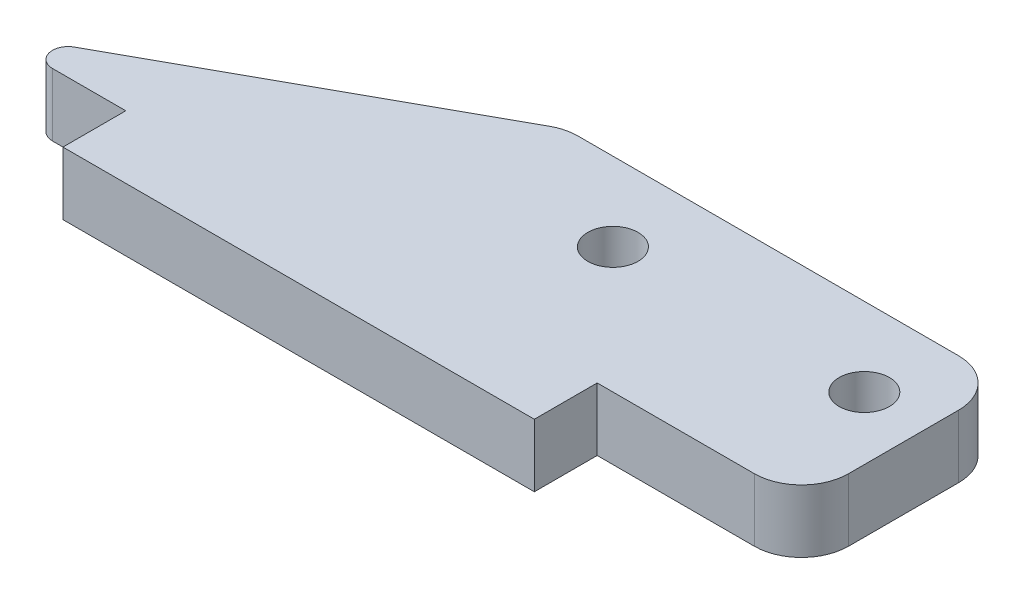
ISO-10303-21;
HEADER;
FILE_DESCRIPTION(('STEP AP214'),'2;1');
FILE_NAME('part.step','',(''),(''),'','','');
FILE_SCHEMA(('AUTOMOTIVE_DESIGN { 1 0 10303 214 1 1 1 1 }'));
ENDSEC;
DATA;
#1=APPLICATION_CONTEXT('core data for automotive mechanical design processes');
#2=APPLICATION_PROTOCOL_DEFINITION('international standard','automotive_design',2000,#1);
#3=PRODUCT_CONTEXT('',#1,'mechanical');
#4=PRODUCT('Part','Part','',(#3));
#5=PRODUCT_RELATED_PRODUCT_CATEGORY('part','',(#4));
#6=PRODUCT_DEFINITION_FORMATION('','',#4);
#7=PRODUCT_DEFINITION_CONTEXT('part definition',#1,'design');
#8=PRODUCT_DEFINITION('design','',#6,#7);
#9=PRODUCT_DEFINITION_SHAPE('','',#8);
#10=(LENGTH_UNIT() NAMED_UNIT(*) SI_UNIT(.MILLI.,.METRE.));
#11=(NAMED_UNIT(*) PLANE_ANGLE_UNIT() SI_UNIT($,.RADIAN.));
#12=(NAMED_UNIT(*) SI_UNIT($,.STERADIAN.) SOLID_ANGLE_UNIT());
#13=UNCERTAINTY_MEASURE_WITH_UNIT(LENGTH_MEASURE(1.E-05),#10,'distance_accuracy_value','');
#14=(GEOMETRIC_REPRESENTATION_CONTEXT(3) GLOBAL_UNCERTAINTY_ASSIGNED_CONTEXT((#13)) GLOBAL_UNIT_ASSIGNED_CONTEXT((#10,
#11,#12)) REPRESENTATION_CONTEXT('',''));
#15=CARTESIAN_POINT('',(0.,0.,0.));
#16=DIRECTION('',(0.,0.,1.));
#17=DIRECTION('',(1.,0.,0.));
#18=AXIS2_PLACEMENT_3D('',#15,#16,#17);
#19=CARTESIAN_POINT('',(-5.50070912957885,4.,-9.96297546508316));
#20=DIRECTION('',(-0.483339706538455,0.,-0.875432880398789));
#21=DIRECTION('',(-0.875432880398789,0.,0.483339706538455));
#22=AXIS2_PLACEMENT_3D('',#19,#20,#21);
#23=PLANE('',#22);
#24=DIRECTION('',(0.875432880398789,0.,-0.483339706538455));
#25=VECTOR('',#24,1.);
#26=CARTESIAN_POINT('',(-5.50070912957885,0.,-9.96297546508316));
#27=LINE('',#26,#25);
#28=CARTESIAN_POINT('',(-20.1490001854985,0.,-1.87543288039879));
#29=VERTEX_POINT('',#28);
#30=CARTESIAN_POINT('',(-0.676854089413362,0.,-12.6262986411964));
#31=VERTEX_POINT('',#30);
#32=EDGE_CURVE('E210',#29,#31,#27,.T.);
#33=ORIENTED_EDGE('',*,*,#32,.F.);
#34=DIRECTION('',(0.,-1.,0.));
#35=VECTOR('',#34,1.);
#36=CARTESIAN_POINT('',(-20.1490001854985,4.,-1.87543288039879));
#37=LINE('',#36,#35);
#38=CARTESIAN_POINT('',(-20.1490001854985,4.,-1.87543288039879));
#39=VERTEX_POINT('',#38);
#40=EDGE_CURVE('E48',#29,#39,#37,.F.);
#41=ORIENTED_EDGE('',*,*,#40,.T.);
#42=DIRECTION('',(0.875432880398789,0.,-0.483339706538455));
#43=VECTOR('',#42,1.);
#44=CARTESIAN_POINT('',(-5.50070912957885,4.,-9.96297546508316));
#45=LINE('',#44,#43);
#46=CARTESIAN_POINT('',(-0.676854089413362,4.,-12.6262986411964));
#47=VERTEX_POINT('',#46);
#48=EDGE_CURVE('E139',#39,#47,#45,.T.);
#49=ORIENTED_EDGE('',*,*,#48,.T.);
#50=DIRECTION('',(0.,-1.,0.));
#51=VECTOR('',#50,1.);
#52=CARTESIAN_POINT('',(-0.676854089413362,0.,-12.6262986411964));
#53=LINE('',#52,#51);
#54=EDGE_CURVE('E197',#47,#31,#53,.T.);
#55=ORIENTED_EDGE('',*,*,#54,.T.);
#56=EDGE_LOOP('',(#33,#41,#49,#55));
#57=FACE_BOUND('',#56,.T.);
#58=ADVANCED_FACE('F39',(#57),#23,.T.);
#59=CARTESIAN_POINT('',(0.,4.,0.));
#60=DIRECTION('',(0.,0.,-1.));
#61=DIRECTION('',(-1.,0.,0.));
#62=AXIS2_PLACEMENT_3D('',#59,#60,#61);
#63=PLANE('',#62);
#64=DIRECTION('',(1.,0.,0.));
#65=VECTOR('',#64,1.);
#66=CARTESIAN_POINT('',(0.,4.,0.));
#67=LINE('',#66,#65);
#68=CARTESIAN_POINT('',(-19.6656604789601,4.,0.));
#69=VERTEX_POINT('',#68);
#70=CARTESIAN_POINT('',(-15.,4.,0.));
#71=VERTEX_POINT('',#70);
#72=EDGE_CURVE('E127',#69,#71,#67,.T.);
#73=ORIENTED_EDGE('',*,*,#72,.F.);
#74=DIRECTION('',(0.,-1.,0.));
#75=VECTOR('',#74,1.);
#76=CARTESIAN_POINT('',(-19.6656604789601,0.,0.));
#77=LINE('',#76,#75);
#78=CARTESIAN_POINT('',(-19.6656604789601,0.,0.));
#79=VERTEX_POINT('',#78);
#80=EDGE_CURVE('E201',#69,#79,#77,.T.);
#81=ORIENTED_EDGE('',*,*,#80,.T.);
#82=DIRECTION('',(1.,0.,0.));
#83=VECTOR('',#82,1.);
#84=CARTESIAN_POINT('',(0.,0.,0.));
#85=LINE('',#84,#83);
#86=CARTESIAN_POINT('',(-15.,0.,0.));
#87=VERTEX_POINT('',#86);
#88=EDGE_CURVE('E152',#79,#87,#85,.T.);
#89=ORIENTED_EDGE('',*,*,#88,.T.);
#90=DIRECTION('',(0.,-1.,0.));
#91=VECTOR('',#90,1.);
#92=CARTESIAN_POINT('',(-15.,4.,0.));
#93=LINE('',#92,#91);
#94=EDGE_CURVE('E145',#71,#87,#93,.T.);
#95=ORIENTED_EDGE('',*,*,#94,.F.);
#96=EDGE_LOOP('',(#73,#81,#89,#95));
#97=FACE_BOUND('',#96,.T.);
#98=ADVANCED_FACE('F151',(#97),#63,.F.);
#99=CARTESIAN_POINT('',(-15.,4.,0.));
#100=DIRECTION('',(1.,0.,0.));
#101=DIRECTION('',(0.,0.,-1.));
#102=AXIS2_PLACEMENT_3D('',#99,#100,#101);
#103=PLANE('',#102);
#104=DIRECTION('',(0.,0.,1.));
#105=VECTOR('',#104,1.);
#106=CARTESIAN_POINT('',(-15.,0.,0.));
#107=LINE('',#106,#105);
#108=CARTESIAN_POINT('',(-15.,0.,4.));
#109=VERTEX_POINT('',#108);
#110=EDGE_CURVE('E208',#87,#109,#107,.T.);
#111=ORIENTED_EDGE('',*,*,#110,.T.);
#112=DIRECTION('',(0.,-1.,0.));
#113=VECTOR('',#112,1.);
#114=CARTESIAN_POINT('',(-15.,4.,4.));
#115=LINE('',#114,#113);
#116=CARTESIAN_POINT('',(-15.,4.,4.));
#117=VERTEX_POINT('',#116);
#118=EDGE_CURVE('E147',#117,#109,#115,.T.);
#119=ORIENTED_EDGE('',*,*,#118,.F.);
#120=DIRECTION('',(0.,0.,1.));
#121=VECTOR('',#120,1.);
#122=CARTESIAN_POINT('',(-15.,4.,0.));
#123=LINE('',#122,#121);
#124=EDGE_CURVE('E131',#71,#117,#123,.T.);
#125=ORIENTED_EDGE('',*,*,#124,.F.);
#126=ORIENTED_EDGE('',*,*,#94,.T.);
#127=EDGE_LOOP('',(#111,#119,#125,#126));
#128=FACE_BOUND('',#127,.T.);
#129=ADVANCED_FACE('F144',(#128),#103,.F.);
#130=CARTESIAN_POINT('',(0.,4.,4.));
#131=DIRECTION('',(0.,0.,-1.));
#132=DIRECTION('',(-1.,0.,0.));
#133=AXIS2_PLACEMENT_3D('',#130,#131,#132);
#134=PLANE('',#133);
#135=DIRECTION('',(1.,0.,0.));
#136=VECTOR('',#135,1.);
#137=CARTESIAN_POINT('',(0.,0.,4.));
#138=LINE('',#137,#136);
#139=CARTESIAN_POINT('',(15.,0.,4.));
#140=VERTEX_POINT('',#139);
#141=EDGE_CURVE('E214',#109,#140,#138,.T.);
#142=ORIENTED_EDGE('',*,*,#141,.T.);
#143=DIRECTION('',(0.,-1.,0.));
#144=VECTOR('',#143,1.);
#145=CARTESIAN_POINT('',(15.,4.,4.));
#146=LINE('',#145,#144);
#147=CARTESIAN_POINT('',(15.,4.,4.));
#148=VERTEX_POINT('',#147);
#149=EDGE_CURVE('E161',#148,#140,#146,.T.);
#150=ORIENTED_EDGE('',*,*,#149,.F.);
#151=DIRECTION('',(1.,0.,0.));
#152=VECTOR('',#151,1.);
#153=CARTESIAN_POINT('',(0.,4.,4.));
#154=LINE('',#153,#152);
#155=EDGE_CURVE('E149',#117,#148,#154,.T.);
#156=ORIENTED_EDGE('',*,*,#155,.F.);
#157=ORIENTED_EDGE('',*,*,#118,.T.);
#158=EDGE_LOOP('',(#142,#150,#156,#157));
#159=FACE_BOUND('',#158,.T.);
#160=ADVANCED_FACE('F253',(#159),#134,.F.);
#161=CARTESIAN_POINT('',(15.,4.,0.));
#162=DIRECTION('',(-1.,0.,0.));
#163=DIRECTION('',(0.,0.,1.));
#164=AXIS2_PLACEMENT_3D('',#161,#162,#163);
#165=PLANE('',#164);
#166=DIRECTION('',(0.,0.,-1.));
#167=VECTOR('',#166,1.);
#168=CARTESIAN_POINT('',(15.,0.,0.));
#169=LINE('',#168,#167);
#170=CARTESIAN_POINT('',(15.,0.,0.));
#171=VERTEX_POINT('',#170);
#172=EDGE_CURVE('E223',#140,#171,#169,.T.);
#173=ORIENTED_EDGE('',*,*,#172,.T.);
#174=DIRECTION('',(0.,-1.,0.));
#175=VECTOR('',#174,1.);
#176=CARTESIAN_POINT('',(15.,4.,0.));
#177=LINE('',#176,#175);
#178=CARTESIAN_POINT('',(15.,4.,0.));
#179=VERTEX_POINT('',#178);
#180=EDGE_CURVE('E240',#179,#171,#177,.T.);
#181=ORIENTED_EDGE('',*,*,#180,.F.);
#182=DIRECTION('',(0.,0.,-1.));
#183=VECTOR('',#182,1.);
#184=CARTESIAN_POINT('',(15.,4.,0.));
#185=LINE('',#184,#183);
#186=EDGE_CURVE('E251',#148,#179,#185,.T.);
#187=ORIENTED_EDGE('',*,*,#186,.F.);
#188=ORIENTED_EDGE('',*,*,#149,.T.);
#189=EDGE_LOOP('',(#173,#181,#187,#188));
#190=FACE_BOUND('',#189,.T.);
#191=ADVANCED_FACE('F248',(#190),#165,.F.);
#192=CARTESIAN_POINT('',(0.,4.,0.));
#193=DIRECTION('',(0.,0.,-1.));
#194=DIRECTION('',(-1.,0.,0.));
#195=AXIS2_PLACEMENT_3D('',#192,#193,#194);
#196=PLANE('',#195);
#197=DIRECTION('',(1.,0.,0.));
#198=VECTOR('',#197,1.);
#199=CARTESIAN_POINT('',(0.,0.,0.));
#200=LINE('',#199,#198);
#201=CARTESIAN_POINT('',(25.,0.,0.));
#202=VERTEX_POINT('',#201);
#203=EDGE_CURVE('E227',#171,#202,#200,.T.);
#204=ORIENTED_EDGE('',*,*,#203,.T.);
#205=DIRECTION('',(0.,-1.,0.));
#206=VECTOR('',#205,1.);
#207=CARTESIAN_POINT('',(25.,4.,0.));
#208=LINE('',#207,#206);
#209=CARTESIAN_POINT('',(25.,4.,0.));
#210=VERTEX_POINT('',#209);
#211=EDGE_CURVE('E194',#202,#210,#208,.F.);
#212=ORIENTED_EDGE('',*,*,#211,.T.);
#213=DIRECTION('',(1.,0.,0.));
#214=VECTOR('',#213,1.);
#215=CARTESIAN_POINT('',(0.,4.,0.));
#216=LINE('',#215,#214);
#217=EDGE_CURVE('E259',#179,#210,#216,.T.);
#218=ORIENTED_EDGE('',*,*,#217,.F.);
#219=ORIENTED_EDGE('',*,*,#180,.T.);
#220=EDGE_LOOP('',(#204,#212,#218,#219));
#221=FACE_BOUND('',#220,.T.);
#222=ADVANCED_FACE('F257',(#221),#196,.F.);
#223=CARTESIAN_POINT('',(28.,4.,0.));
#224=DIRECTION('',(-1.,0.,0.));
#225=DIRECTION('',(0.,0.,1.));
#226=AXIS2_PLACEMENT_3D('',#223,#224,#225);
#227=PLANE('',#226);
#228=DIRECTION('',(0.,0.,-1.));
#229=VECTOR('',#228,1.);
#230=CARTESIAN_POINT('',(28.,0.,0.));
#231=LINE('',#230,#229);
#232=CARTESIAN_POINT('',(28.,0.,-3.));
#233=VERTEX_POINT('',#232);
#234=CARTESIAN_POINT('',(28.,0.,-10.));
#235=VERTEX_POINT('',#234);
#236=EDGE_CURVE('E231',#233,#235,#231,.T.);
#237=ORIENTED_EDGE('',*,*,#236,.T.);
#238=DIRECTION('',(0.,-1.,0.));
#239=VECTOR('',#238,1.);
#240=CARTESIAN_POINT('',(28.,4.,-10.));
#241=LINE('',#240,#239);
#242=CARTESIAN_POINT('',(28.,4.,-10.));
#243=VERTEX_POINT('',#242);
#244=EDGE_CURVE('E181',#235,#243,#241,.F.);
#245=ORIENTED_EDGE('',*,*,#244,.T.);
#246=DIRECTION('',(0.,0.,-1.));
#247=VECTOR('',#246,1.);
#248=CARTESIAN_POINT('',(28.,4.,0.));
#249=LINE('',#248,#247);
#250=CARTESIAN_POINT('',(28.,4.,-3.));
#251=VERTEX_POINT('',#250);
#252=EDGE_CURVE('E262',#251,#243,#249,.T.);
#253=ORIENTED_EDGE('',*,*,#252,.F.);
#254=DIRECTION('',(0.,-1.,0.));
#255=VECTOR('',#254,1.);
#256=CARTESIAN_POINT('',(28.,4.,-3.));
#257=LINE('',#256,#255);
#258=EDGE_CURVE('E177',#251,#233,#257,.T.);
#259=ORIENTED_EDGE('',*,*,#258,.T.);
#260=EDGE_LOOP('',(#237,#245,#253,#259));
#261=FACE_BOUND('',#260,.T.);
#262=ADVANCED_FACE('F286',(#261),#227,.F.);
#263=CARTESIAN_POINT('',(8.,4.,-8.));
#264=DIRECTION('',(0.,-1.,0.));
#265=DIRECTION('',(0.,0.,-1.));
#266=AXIS2_PLACEMENT_3D('',#263,#264,#265);
#267=CYLINDRICAL_SURFACE('',#266,1.6);
#268=CARTESIAN_POINT('',(8.,4.,-8.));
#269=DIRECTION('',(0.,1.,0.));
#270=DIRECTION('',(0.,0.,1.));
#271=AXIS2_PLACEMENT_3D('',#268,#269,#270);
#272=CIRCLE('',#271,1.6);
#273=CARTESIAN_POINT('',(8.,4.,-6.4));
#274=VERTEX_POINT('',#273);
#275=EDGE_CURVE('E329',#274,#274,#272,.T.);
#276=ORIENTED_EDGE('',*,*,#275,.T.);
#277=EDGE_LOOP('',(#276));
#278=FACE_BOUND('',#277,.T.);
#279=CARTESIAN_POINT('',(8.,0.,-8.));
#280=DIRECTION('',(0.,1.,0.));
#281=DIRECTION('',(0.,0.,1.));
#282=AXIS2_PLACEMENT_3D('',#279,#280,#281);
#283=CIRCLE('',#282,1.6);
#284=CARTESIAN_POINT('',(8.,0.,-6.4));
#285=VERTEX_POINT('',#284);
#286=EDGE_CURVE('E216',#285,#285,#283,.T.);
#287=ORIENTED_EDGE('',*,*,#286,.F.);
#288=EDGE_LOOP('',(#287));
#289=FACE_BOUND('',#288,.T.);
#290=ADVANCED_FACE('F283',(#278,#289),#267,.F.);
#291=CARTESIAN_POINT('',(24.,4.,-8.));
#292=DIRECTION('',(0.,-1.,0.));
#293=DIRECTION('',(0.,0.,-1.));
#294=AXIS2_PLACEMENT_3D('',#291,#292,#293);
#295=CYLINDRICAL_SURFACE('',#294,1.6);
#296=CARTESIAN_POINT('',(24.,4.,-8.));
#297=DIRECTION('',(0.,1.,0.));
#298=DIRECTION('',(0.,0.,1.));
#299=AXIS2_PLACEMENT_3D('',#296,#297,#298);
#300=CIRCLE('',#299,1.6);
#301=CARTESIAN_POINT('',(24.,4.,-6.4));
#302=VERTEX_POINT('',#301);
#303=EDGE_CURVE('E239',#302,#302,#300,.T.);
#304=ORIENTED_EDGE('',*,*,#303,.T.);
#305=EDGE_LOOP('',(#304));
#306=FACE_BOUND('',#305,.T.);
#307=CARTESIAN_POINT('',(24.,0.,-8.));
#308=DIRECTION('',(0.,1.,0.));
#309=DIRECTION('',(0.,0.,1.));
#310=AXIS2_PLACEMENT_3D('',#307,#308,#309);
#311=CIRCLE('',#310,1.6);
#312=CARTESIAN_POINT('',(24.,0.,-6.4));
#313=VERTEX_POINT('',#312);
#314=EDGE_CURVE('E275',#313,#313,#311,.T.);
#315=ORIENTED_EDGE('',*,*,#314,.F.);
#316=EDGE_LOOP('',(#315));
#317=FACE_BOUND('',#316,.T.);
#318=ADVANCED_FACE('F285',(#306,#317),#295,.F.);
#319=CARTESIAN_POINT('',(0.,4.,-13.));
#320=DIRECTION('',(0.,0.,1.));
#321=DIRECTION('',(1.,0.,0.));
#322=AXIS2_PLACEMENT_3D('',#319,#320,#321);
#323=PLANE('',#322);
#324=DIRECTION('',(-1.,0.,0.));
#325=VECTOR('',#324,1.);
#326=CARTESIAN_POINT('',(0.,4.,-13.));
#327=LINE('',#326,#325);
#328=CARTESIAN_POINT('',(25.,4.,-13.));
#329=VERTEX_POINT('',#328);
#330=CARTESIAN_POINT('',(0.773165030202004,4.,-13.));
#331=VERTEX_POINT('',#330);
#332=EDGE_CURVE('E243',#329,#331,#327,.T.);
#333=ORIENTED_EDGE('',*,*,#332,.F.);
#334=DIRECTION('',(0.,-1.,0.));
#335=VECTOR('',#334,1.);
#336=CARTESIAN_POINT('',(25.,4.,-13.));
#337=LINE('',#336,#335);
#338=CARTESIAN_POINT('',(25.,0.,-13.));
#339=VERTEX_POINT('',#338);
#340=EDGE_CURVE('E159',#329,#339,#337,.T.);
#341=ORIENTED_EDGE('',*,*,#340,.T.);
#342=DIRECTION('',(-1.,0.,0.));
#343=VECTOR('',#342,1.);
#344=CARTESIAN_POINT('',(0.,0.,-13.));
#345=LINE('',#344,#343);
#346=CARTESIAN_POINT('',(0.773165030202004,0.,-13.));
#347=VERTEX_POINT('',#346);
#348=EDGE_CURVE('E235',#339,#347,#345,.T.);
#349=ORIENTED_EDGE('',*,*,#348,.T.);
#350=DIRECTION('',(0.,-1.,0.));
#351=VECTOR('',#350,1.);
#352=CARTESIAN_POINT('',(0.773165030202004,4.,-13.));
#353=LINE('',#352,#351);
#354=EDGE_CURVE('E155',#347,#331,#353,.F.);
#355=ORIENTED_EDGE('',*,*,#354,.T.);
#356=EDGE_LOOP('',(#333,#341,#349,#355));
#357=FACE_BOUND('',#356,.T.);
#358=ADVANCED_FACE('F293',(#357),#323,.F.);
#359=CARTESIAN_POINT('',(0.,4.,0.));
#360=DIRECTION('',(0.,1.,0.));
#361=DIRECTION('',(0.,0.,1.));
#362=AXIS2_PLACEMENT_3D('',#359,#360,#361);
#363=PLANE('',#362);
#364=ORIENTED_EDGE('',*,*,#303,.F.);
#365=EDGE_LOOP('',(#364));
#366=FACE_BOUND('',#365,.T.);
#367=ORIENTED_EDGE('',*,*,#275,.F.);
#368=EDGE_LOOP('',(#367));
#369=FACE_BOUND('',#368,.T.);
#370=ORIENTED_EDGE('',*,*,#48,.F.);
#371=CARTESIAN_POINT('',(-19.6656604789601,4.,-1.));
#372=DIRECTION('',(0.,1.,0.));
#373=DIRECTION('',(0.,0.,1.));
#374=AXIS2_PLACEMENT_3D('',#371,#372,#373);
#375=CIRCLE('',#374,1.);
#376=EDGE_CURVE('E11',#39,#69,#375,.T.);
#377=ORIENTED_EDGE('',*,*,#376,.T.);
#378=ORIENTED_EDGE('',*,*,#72,.T.);
#379=ORIENTED_EDGE('',*,*,#124,.T.);
#380=ORIENTED_EDGE('',*,*,#155,.T.);
#381=ORIENTED_EDGE('',*,*,#186,.T.);
#382=ORIENTED_EDGE('',*,*,#217,.T.);
#383=CARTESIAN_POINT('',(25.,4.,-3.));
#384=DIRECTION('',(0.,1.,0.));
#385=DIRECTION('',(0.,0.,1.));
#386=AXIS2_PLACEMENT_3D('',#383,#384,#385);
#387=CIRCLE('',#386,3.);
#388=EDGE_CURVE('E188',#210,#251,#387,.T.);
#389=ORIENTED_EDGE('',*,*,#388,.T.);
#390=ORIENTED_EDGE('',*,*,#252,.T.);
#391=CARTESIAN_POINT('',(25.,4.,-10.));
#392=DIRECTION('',(0.,1.,0.));
#393=DIRECTION('',(0.,0.,1.));
#394=AXIS2_PLACEMENT_3D('',#391,#392,#393);
#395=CIRCLE('',#394,3.);
#396=EDGE_CURVE('E191',#243,#329,#395,.T.);
#397=ORIENTED_EDGE('',*,*,#396,.T.);
#398=ORIENTED_EDGE('',*,*,#332,.T.);
#399=CARTESIAN_POINT('',(0.773165030202004,4.,-10.));
#400=DIRECTION('',(0.,1.,0.));
#401=DIRECTION('',(0.,0.,1.));
#402=AXIS2_PLACEMENT_3D('',#399,#400,#401);
#403=CIRCLE('',#402,3.);
#404=EDGE_CURVE('E184',#331,#47,#403,.T.);
#405=ORIENTED_EDGE('',*,*,#404,.T.);
#406=EDGE_LOOP('',(#370,#377,#378,#379,#380,#381,#382,#389,#390,#397,#398,#405));
#407=FACE_BOUND('',#406,.T.);
#408=ADVANCED_FACE('F129',(#366,#369,#407),#363,.T.);
#409=CARTESIAN_POINT('',(0.,0.,0.));
#410=DIRECTION('',(0.,1.,0.));
#411=DIRECTION('',(0.,0.,1.));
#412=AXIS2_PLACEMENT_3D('',#409,#410,#411);
#413=PLANE('',#412);
#414=ORIENTED_EDGE('',*,*,#314,.T.);
#415=EDGE_LOOP('',(#414));
#416=FACE_BOUND('',#415,.T.);
#417=ORIENTED_EDGE('',*,*,#286,.T.);
#418=EDGE_LOOP('',(#417));
#419=FACE_BOUND('',#418,.T.);
#420=ORIENTED_EDGE('',*,*,#88,.F.);
#421=CARTESIAN_POINT('',(-19.6656604789601,0.,-1.));
#422=DIRECTION('',(0.,1.,0.));
#423=DIRECTION('',(0.,0.,1.));
#424=AXIS2_PLACEMENT_3D('',#421,#422,#423);
#425=CIRCLE('',#424,1.);
#426=EDGE_CURVE('E62',#79,#29,#425,.F.);
#427=ORIENTED_EDGE('',*,*,#426,.T.);
#428=ORIENTED_EDGE('',*,*,#32,.T.);
#429=CARTESIAN_POINT('',(0.773165030202004,0.,-10.));
#430=DIRECTION('',(0.,1.,0.));
#431=DIRECTION('',(0.,0.,1.));
#432=AXIS2_PLACEMENT_3D('',#429,#430,#431);
#433=CIRCLE('',#432,3.);
#434=EDGE_CURVE('E168',#31,#347,#433,.F.);
#435=ORIENTED_EDGE('',*,*,#434,.T.);
#436=ORIENTED_EDGE('',*,*,#348,.F.);
#437=CARTESIAN_POINT('',(25.,0.,-10.));
#438=DIRECTION('',(0.,1.,0.));
#439=DIRECTION('',(0.,0.,1.));
#440=AXIS2_PLACEMENT_3D('',#437,#438,#439);
#441=CIRCLE('',#440,3.);
#442=EDGE_CURVE('E174',#339,#235,#441,.F.);
#443=ORIENTED_EDGE('',*,*,#442,.T.);
#444=ORIENTED_EDGE('',*,*,#236,.F.);
#445=CARTESIAN_POINT('',(25.,0.,-3.));
#446=DIRECTION('',(0.,1.,0.));
#447=DIRECTION('',(0.,0.,1.));
#448=AXIS2_PLACEMENT_3D('',#445,#446,#447);
#449=CIRCLE('',#448,3.);
#450=EDGE_CURVE('E171',#233,#202,#449,.F.);
#451=ORIENTED_EDGE('',*,*,#450,.T.);
#452=ORIENTED_EDGE('',*,*,#203,.F.);
#453=ORIENTED_EDGE('',*,*,#172,.F.);
#454=ORIENTED_EDGE('',*,*,#141,.F.);
#455=ORIENTED_EDGE('',*,*,#110,.F.);
#456=EDGE_LOOP('',(#420,#427,#428,#435,#436,#443,#444,#451,#452,#453,#454,#455));
#457=FACE_BOUND('',#456,.T.);
#458=ADVANCED_FACE('F207',(#416,#419,#457),#413,.F.);
#459=CARTESIAN_POINT('',(25.,4.,-10.));
#460=DIRECTION('',(0.,-1.,0.));
#461=DIRECTION('',(0.,0.,-1.));
#462=AXIS2_PLACEMENT_3D('',#459,#460,#461);
#463=CYLINDRICAL_SURFACE('',#462,3.);
#464=ORIENTED_EDGE('',*,*,#396,.F.);
#465=ORIENTED_EDGE('',*,*,#244,.F.);
#466=ORIENTED_EDGE('',*,*,#442,.F.);
#467=ORIENTED_EDGE('',*,*,#340,.F.);
#468=EDGE_LOOP('',(#464,#465,#466,#467));
#469=FACE_BOUND('',#468,.T.);
#470=ADVANCED_FACE('F319',(#469),#463,.T.);
#471=CARTESIAN_POINT('',(25.,4.,-3.));
#472=DIRECTION('',(0.,-1.,0.));
#473=DIRECTION('',(0.,0.,-1.));
#474=AXIS2_PLACEMENT_3D('',#471,#472,#473);
#475=CYLINDRICAL_SURFACE('',#474,3.);
#476=ORIENTED_EDGE('',*,*,#388,.F.);
#477=ORIENTED_EDGE('',*,*,#211,.F.);
#478=ORIENTED_EDGE('',*,*,#450,.F.);
#479=ORIENTED_EDGE('',*,*,#258,.F.);
#480=EDGE_LOOP('',(#476,#477,#478,#479));
#481=FACE_BOUND('',#480,.T.);
#482=ADVANCED_FACE('F353',(#481),#475,.T.);
#483=CARTESIAN_POINT('',(0.773165030202004,4.,-10.));
#484=DIRECTION('',(0.,1.,0.));
#485=DIRECTION('',(0.,0.,1.));
#486=AXIS2_PLACEMENT_3D('',#483,#484,#485);
#487=CYLINDRICAL_SURFACE('',#486,3.);
#488=ORIENTED_EDGE('',*,*,#404,.F.);
#489=ORIENTED_EDGE('',*,*,#354,.F.);
#490=ORIENTED_EDGE('',*,*,#434,.F.);
#491=ORIENTED_EDGE('',*,*,#54,.F.);
#492=EDGE_LOOP('',(#488,#489,#490,#491));
#493=FACE_BOUND('',#492,.T.);
#494=ADVANCED_FACE('F344',(#493),#487,.T.);
#495=CARTESIAN_POINT('',(-19.6656604789601,4.,-1.));
#496=DIRECTION('',(0.,1.,0.));
#497=DIRECTION('',(0.,0.,1.));
#498=AXIS2_PLACEMENT_3D('',#495,#496,#497);
#499=CYLINDRICAL_SURFACE('',#498,1.);
#500=ORIENTED_EDGE('',*,*,#376,.F.);
#501=ORIENTED_EDGE('',*,*,#40,.F.);
#502=ORIENTED_EDGE('',*,*,#426,.F.);
#503=ORIENTED_EDGE('',*,*,#80,.F.);
#504=EDGE_LOOP('',(#500,#501,#502,#503));
#505=FACE_BOUND('',#504,.T.);
#506=ADVANCED_FACE('F41',(#505),#499,.T.);
#507=CLOSED_SHELL('',(#58,#98,#129,#160,#191,#222,#262,#290,#318,#358,#408,#458,#470,#482,#494,#506));
#508=MANIFOLD_SOLID_BREP('B2',#507);
#509=ADVANCED_BREP_SHAPE_REPRESENTATION('',(#18,#508),#14);
#510=SHAPE_DEFINITION_REPRESENTATION(#9,#509);
ENDSEC;
END-ISO-10303-21;
